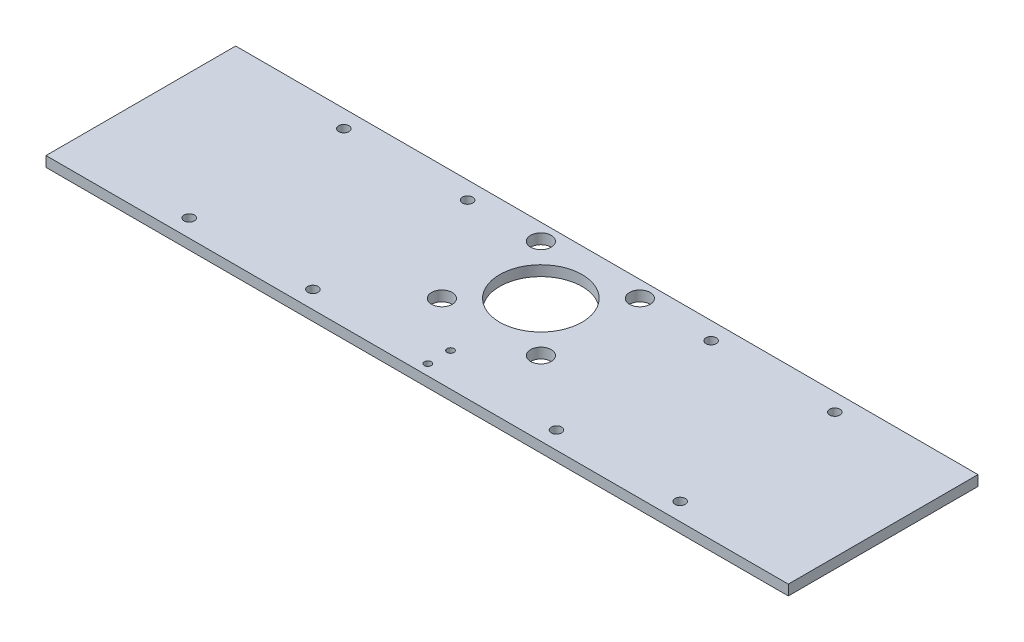
ISO-10303-21;
HEADER;
FILE_DESCRIPTION(('STEP AP214'),'2;1');
FILE_NAME('part.step','',(''),(''),'','','');
FILE_SCHEMA(('AUTOMOTIVE_DESIGN { 1 0 10303 214 1 1 1 1 }'));
ENDSEC;
DATA;
#1=APPLICATION_CONTEXT('core data for automotive mechanical design processes');
#2=APPLICATION_PROTOCOL_DEFINITION('international standard','automotive_design',2000,#1);
#3=PRODUCT_CONTEXT('',#1,'mechanical');
#4=PRODUCT('Part','Part','',(#3));
#5=PRODUCT_RELATED_PRODUCT_CATEGORY('part','',(#4));
#6=PRODUCT_DEFINITION_FORMATION('','',#4);
#7=PRODUCT_DEFINITION_CONTEXT('part definition',#1,'design');
#8=PRODUCT_DEFINITION('design','',#6,#7);
#9=PRODUCT_DEFINITION_SHAPE('','',#8);
#10=(LENGTH_UNIT() NAMED_UNIT(*) SI_UNIT(.MILLI.,.METRE.));
#11=(NAMED_UNIT(*) PLANE_ANGLE_UNIT() SI_UNIT($,.RADIAN.));
#12=(NAMED_UNIT(*) SI_UNIT($,.STERADIAN.) SOLID_ANGLE_UNIT());
#13=UNCERTAINTY_MEASURE_WITH_UNIT(LENGTH_MEASURE(1.E-05),#10,'distance_accuracy_value','');
#14=(GEOMETRIC_REPRESENTATION_CONTEXT(3) GLOBAL_UNCERTAINTY_ASSIGNED_CONTEXT((#13)) GLOBAL_UNIT_ASSIGNED_CONTEXT((#10,
#11,#12)) REPRESENTATION_CONTEXT('',''));
#15=CARTESIAN_POINT('',(0.,0.,0.));
#16=DIRECTION('',(0.,0.,1.));
#17=DIRECTION('',(1.,0.,0.));
#18=AXIS2_PLACEMENT_3D('',#15,#16,#17);
#19=CARTESIAN_POINT('',(-228.6,3.175,-40.64));
#20=DIRECTION('',(1.,0.,0.));
#21=DIRECTION('',(0.,0.,-1.));
#22=AXIS2_PLACEMENT_3D('',#19,#20,#21);
#23=PLANE('',#22);
#24=DIRECTION('',(0.,0.,1.));
#25=VECTOR('',#24,1.);
#26=CARTESIAN_POINT('',(-228.6,-3.175,-40.64));
#27=LINE('',#26,#25);
#28=CARTESIAN_POINT('',(-228.6,-3.175,-40.64));
#29=VERTEX_POINT('',#28);
#30=CARTESIAN_POINT('',(-228.6,-3.175,76.2));
#31=VERTEX_POINT('',#30);
#32=EDGE_CURVE('E98',#29,#31,#27,.T.);
#33=ORIENTED_EDGE('',*,*,#32,.T.);
#34=DIRECTION('',(0.,-1.,0.));
#35=VECTOR('',#34,1.);
#36=CARTESIAN_POINT('',(-228.6,3.175,76.2));
#37=LINE('',#36,#35);
#38=CARTESIAN_POINT('',(-228.6,3.175,76.2));
#39=VERTEX_POINT('',#38);
#40=EDGE_CURVE('E11',#39,#31,#37,.T.);
#41=ORIENTED_EDGE('',*,*,#40,.F.);
#42=DIRECTION('',(0.,0.,1.));
#43=VECTOR('',#42,1.);
#44=CARTESIAN_POINT('',(-228.6,3.175,-40.64));
#45=LINE('',#44,#43);
#46=CARTESIAN_POINT('',(-228.6,3.175,-40.64));
#47=VERTEX_POINT('',#46);
#48=EDGE_CURVE('E86',#47,#39,#45,.T.);
#49=ORIENTED_EDGE('',*,*,#48,.F.);
#50=DIRECTION('',(0.,-1.,0.));
#51=VECTOR('',#50,1.);
#52=CARTESIAN_POINT('',(-228.6,3.175,-40.64));
#53=LINE('',#52,#51);
#54=EDGE_CURVE('E94',#47,#29,#53,.T.);
#55=ORIENTED_EDGE('',*,*,#54,.T.);
#56=EDGE_LOOP('',(#33,#41,#49,#55));
#57=FACE_BOUND('',#56,.T.);
#58=ADVANCED_FACE('F35',(#57),#23,.F.);
#59=CARTESIAN_POINT('',(-228.6,3.175,76.2));
#60=DIRECTION('',(0.,0.,-1.));
#61=DIRECTION('',(-1.,0.,0.));
#62=AXIS2_PLACEMENT_3D('',#59,#60,#61);
#63=PLANE('',#62);
#64=DIRECTION('',(1.,0.,0.));
#65=VECTOR('',#64,1.);
#66=CARTESIAN_POINT('',(-228.6,-3.175,76.2));
#67=LINE('',#66,#65);
#68=CARTESIAN_POINT('',(228.6,-3.175,76.2));
#69=VERTEX_POINT('',#68);
#70=EDGE_CURVE('E90',#31,#69,#67,.T.);
#71=ORIENTED_EDGE('',*,*,#70,.T.);
#72=DIRECTION('',(0.,-1.,0.));
#73=VECTOR('',#72,1.);
#74=CARTESIAN_POINT('',(228.6,3.175,76.2));
#75=LINE('',#74,#73);
#76=CARTESIAN_POINT('',(228.6,3.175,76.2));
#77=VERTEX_POINT('',#76);
#78=EDGE_CURVE('E43',#77,#69,#75,.T.);
#79=ORIENTED_EDGE('',*,*,#78,.F.);
#80=DIRECTION('',(1.,0.,0.));
#81=VECTOR('',#80,1.);
#82=CARTESIAN_POINT('',(-228.6,3.175,76.2));
#83=LINE('',#82,#81);
#84=EDGE_CURVE('E81',#39,#77,#83,.T.);
#85=ORIENTED_EDGE('',*,*,#84,.F.);
#86=ORIENTED_EDGE('',*,*,#40,.T.);
#87=EDGE_LOOP('',(#71,#79,#85,#86));
#88=FACE_BOUND('',#87,.T.);
#89=ADVANCED_FACE('F89',(#88),#63,.F.);
#90=CARTESIAN_POINT('',(228.6,3.175,-40.64));
#91=DIRECTION('',(-1.,0.,0.));
#92=DIRECTION('',(0.,0.,1.));
#93=AXIS2_PLACEMENT_3D('',#90,#91,#92);
#94=PLANE('',#93);
#95=DIRECTION('',(0.,0.,-1.));
#96=VECTOR('',#95,1.);
#97=CARTESIAN_POINT('',(228.6,-3.175,-40.64));
#98=LINE('',#97,#96);
#99=CARTESIAN_POINT('',(228.6,-3.175,-40.64));
#100=VERTEX_POINT('',#99);
#101=EDGE_CURVE('E68',#69,#100,#98,.T.);
#102=ORIENTED_EDGE('',*,*,#101,.T.);
#103=DIRECTION('',(0.,-1.,0.));
#104=VECTOR('',#103,1.);
#105=CARTESIAN_POINT('',(228.6,3.175,-40.64));
#106=LINE('',#105,#104);
#107=CARTESIAN_POINT('',(228.6,3.175,-40.64));
#108=VERTEX_POINT('',#107);
#109=EDGE_CURVE('E91',#108,#100,#106,.T.);
#110=ORIENTED_EDGE('',*,*,#109,.F.);
#111=DIRECTION('',(0.,0.,-1.));
#112=VECTOR('',#111,1.);
#113=CARTESIAN_POINT('',(228.6,3.175,-40.64));
#114=LINE('',#113,#112);
#115=EDGE_CURVE('E84',#77,#108,#114,.T.);
#116=ORIENTED_EDGE('',*,*,#115,.F.);
#117=ORIENTED_EDGE('',*,*,#78,.T.);
#118=EDGE_LOOP('',(#102,#110,#116,#117));
#119=FACE_BOUND('',#118,.T.);
#120=ADVANCED_FACE('F92',(#119),#94,.F.);
#121=CARTESIAN_POINT('',(-228.6,3.175,-40.64));
#122=DIRECTION('',(0.,0.,1.));
#123=DIRECTION('',(1.,0.,0.));
#124=AXIS2_PLACEMENT_3D('',#121,#122,#123);
#125=PLANE('',#124);
#126=DIRECTION('',(-1.,0.,0.));
#127=VECTOR('',#126,1.);
#128=CARTESIAN_POINT('',(-228.6,-3.175,-40.64));
#129=LINE('',#128,#127);
#130=EDGE_CURVE('E74',#100,#29,#129,.T.);
#131=ORIENTED_EDGE('',*,*,#130,.T.);
#132=ORIENTED_EDGE('',*,*,#54,.F.);
#133=DIRECTION('',(-1.,0.,0.));
#134=VECTOR('',#133,1.);
#135=CARTESIAN_POINT('',(-228.6,3.175,-40.64));
#136=LINE('',#135,#134);
#137=EDGE_CURVE('E51',#108,#47,#136,.T.);
#138=ORIENTED_EDGE('',*,*,#137,.F.);
#139=ORIENTED_EDGE('',*,*,#109,.T.);
#140=EDGE_LOOP('',(#131,#132,#138,#139));
#141=FACE_BOUND('',#140,.T.);
#142=ADVANCED_FACE('F106',(#141),#125,.F.);
#143=CARTESIAN_POINT('',(0.,3.175,0.));
#144=DIRECTION('',(0.,1.,0.));
#145=DIRECTION('',(0.,0.,1.));
#146=AXIS2_PLACEMENT_3D('',#143,#144,#145);
#147=PLANE('',#146);
#148=CARTESIAN_POINT('',(151.2,3.175,65.405));
#149=DIRECTION('',(0.,1.,0.));
#150=DIRECTION('',(0.,0.,1.));
#151=AXIS2_PLACEMENT_3D('',#148,#149,#150);
#152=CIRCLE('',#151,3.175);
#153=CARTESIAN_POINT('',(151.2,3.175,68.58));
#154=VERTEX_POINT('',#153);
#155=EDGE_CURVE('E198',#154,#154,#152,.T.);
#156=ORIENTED_EDGE('',*,*,#155,.F.);
#157=EDGE_LOOP('',(#156));
#158=FACE_BOUND('',#157,.T.);
#159=CARTESIAN_POINT('',(151.2,3.175,-29.845));
#160=DIRECTION('',(0.,1.,0.));
#161=DIRECTION('',(0.,0.,1.));
#162=AXIS2_PLACEMENT_3D('',#159,#160,#161);
#163=CIRCLE('',#162,3.175);
#164=CARTESIAN_POINT('',(151.2,3.175,-26.67));
#165=VERTEX_POINT('',#164);
#166=EDGE_CURVE('E192',#165,#165,#163,.T.);
#167=ORIENTED_EDGE('',*,*,#166,.F.);
#168=EDGE_LOOP('',(#167));
#169=FACE_BOUND('',#168,.T.);
#170=CARTESIAN_POINT('',(-151.2,3.175,65.4050000000001));
#171=DIRECTION('',(0.,1.,0.));
#172=DIRECTION('',(0.,0.,1.));
#173=AXIS2_PLACEMENT_3D('',#170,#171,#172);
#174=CIRCLE('',#173,3.175);
#175=CARTESIAN_POINT('',(-151.2,3.175,68.5800000000001));
#176=VERTEX_POINT('',#175);
#177=EDGE_CURVE('E186',#176,#176,#174,.T.);
#178=ORIENTED_EDGE('',*,*,#177,.F.);
#179=EDGE_LOOP('',(#178));
#180=FACE_BOUND('',#179,.T.);
#181=CARTESIAN_POINT('',(-151.2,3.175,-29.845));
#182=DIRECTION('',(0.,1.,0.));
#183=DIRECTION('',(0.,0.,1.));
#184=AXIS2_PLACEMENT_3D('',#181,#182,#183);
#185=CIRCLE('',#184,3.175);
#186=CARTESIAN_POINT('',(-151.2,3.175,-26.67));
#187=VERTEX_POINT('',#186);
#188=EDGE_CURVE('E180',#187,#187,#185,.T.);
#189=ORIENTED_EDGE('',*,*,#188,.F.);
#190=EDGE_LOOP('',(#189));
#191=FACE_BOUND('',#190,.T.);
#192=CARTESIAN_POINT('',(75.,3.175,65.405));
#193=DIRECTION('',(0.,1.,0.));
#194=DIRECTION('',(0.,0.,1.));
#195=AXIS2_PLACEMENT_3D('',#192,#193,#194);
#196=CIRCLE('',#195,3.175);
#197=CARTESIAN_POINT('',(75.,3.175,68.58));
#198=VERTEX_POINT('',#197);
#199=EDGE_CURVE('E174',#198,#198,#196,.T.);
#200=ORIENTED_EDGE('',*,*,#199,.F.);
#201=EDGE_LOOP('',(#200));
#202=FACE_BOUND('',#201,.T.);
#203=CARTESIAN_POINT('',(-75.,3.175,-29.845));
#204=DIRECTION('',(0.,1.,0.));
#205=DIRECTION('',(0.,0.,1.));
#206=AXIS2_PLACEMENT_3D('',#203,#204,#205);
#207=CIRCLE('',#206,3.175);
#208=CARTESIAN_POINT('',(-75.,3.175,-26.67));
#209=VERTEX_POINT('',#208);
#210=EDGE_CURVE('E168',#209,#209,#207,.T.);
#211=ORIENTED_EDGE('',*,*,#210,.F.);
#212=EDGE_LOOP('',(#211));
#213=FACE_BOUND('',#212,.T.);
#214=CARTESIAN_POINT('',(-75.,3.175,65.405));
#215=DIRECTION('',(0.,1.,0.));
#216=DIRECTION('',(0.,0.,1.));
#217=AXIS2_PLACEMENT_3D('',#214,#215,#216);
#218=CIRCLE('',#217,3.175);
#219=CARTESIAN_POINT('',(-75.,3.175,68.58));
#220=VERTEX_POINT('',#219);
#221=EDGE_CURVE('E162',#220,#220,#218,.T.);
#222=ORIENTED_EDGE('',*,*,#221,.F.);
#223=EDGE_LOOP('',(#222));
#224=FACE_BOUND('',#223,.T.);
#225=CARTESIAN_POINT('',(75.,3.175,-29.845));
#226=DIRECTION('',(0.,1.,0.));
#227=DIRECTION('',(0.,0.,1.));
#228=AXIS2_PLACEMENT_3D('',#225,#226,#227);
#229=CIRCLE('',#228,3.175);
#230=CARTESIAN_POINT('',(75.,3.175,-26.67));
#231=VERTEX_POINT('',#230);
#232=EDGE_CURVE('E156',#231,#231,#229,.T.);
#233=ORIENTED_EDGE('',*,*,#232,.F.);
#234=EDGE_LOOP('',(#233));
#235=FACE_BOUND('',#234,.T.);
#236=CARTESIAN_POINT('',(0.,3.175,55.63));
#237=DIRECTION('',(0.,1.,0.));
#238=DIRECTION('',(0.,0.,1.));
#239=AXIS2_PLACEMENT_3D('',#236,#237,#238);
#240=CIRCLE('',#239,2.1082);
#241=CARTESIAN_POINT('',(0.,3.175,57.7382));
#242=VERTEX_POINT('',#241);
#243=EDGE_CURVE('E150',#242,#242,#240,.T.);
#244=ORIENTED_EDGE('',*,*,#243,.F.);
#245=EDGE_LOOP('',(#244));
#246=FACE_BOUND('',#245,.T.);
#247=CARTESIAN_POINT('',(0.,3.175,69.63));
#248=DIRECTION('',(0.,1.,0.));
#249=DIRECTION('',(0.,0.,1.));
#250=AXIS2_PLACEMENT_3D('',#247,#248,#249);
#251=CIRCLE('',#250,2.1082);
#252=CARTESIAN_POINT('',(0.,3.175,71.7382));
#253=VERTEX_POINT('',#252);
#254=EDGE_CURVE('E144',#253,#253,#251,.T.);
#255=ORIENTED_EDGE('',*,*,#254,.F.);
#256=EDGE_LOOP('',(#255));
#257=FACE_BOUND('',#256,.T.);
#258=CARTESIAN_POINT('',(30.48,3.175,30.48));
#259=DIRECTION('',(0.,1.,0.));
#260=DIRECTION('',(0.,0.,1.));
#261=AXIS2_PLACEMENT_3D('',#258,#259,#260);
#262=CIRCLE('',#261,6.35);
#263=CARTESIAN_POINT('',(30.48,3.175,36.83));
#264=VERTEX_POINT('',#263);
#265=EDGE_CURVE('E138',#264,#264,#262,.T.);
#266=ORIENTED_EDGE('',*,*,#265,.F.);
#267=EDGE_LOOP('',(#266));
#268=FACE_BOUND('',#267,.T.);
#269=CARTESIAN_POINT('',(-30.48,3.175,-30.48));
#270=DIRECTION('',(0.,1.,0.));
#271=DIRECTION('',(0.,0.,1.));
#272=AXIS2_PLACEMENT_3D('',#269,#270,#271);
#273=CIRCLE('',#272,6.35);
#274=CARTESIAN_POINT('',(-30.48,3.175,-24.13));
#275=VERTEX_POINT('',#274);
#276=EDGE_CURVE('E132',#275,#275,#273,.T.);
#277=ORIENTED_EDGE('',*,*,#276,.F.);
#278=EDGE_LOOP('',(#277));
#279=FACE_BOUND('',#278,.T.);
#280=CARTESIAN_POINT('',(-30.48,3.175,30.48));
#281=DIRECTION('',(0.,1.,0.));
#282=DIRECTION('',(0.,0.,1.));
#283=AXIS2_PLACEMENT_3D('',#280,#281,#282);
#284=CIRCLE('',#283,6.35);
#285=CARTESIAN_POINT('',(-30.48,3.175,36.83));
#286=VERTEX_POINT('',#285);
#287=EDGE_CURVE('E126',#286,#286,#284,.T.);
#288=ORIENTED_EDGE('',*,*,#287,.F.);
#289=EDGE_LOOP('',(#288));
#290=FACE_BOUND('',#289,.T.);
#291=CARTESIAN_POINT('',(30.48,3.175,-30.48));
#292=DIRECTION('',(0.,1.,0.));
#293=DIRECTION('',(0.,0.,1.));
#294=AXIS2_PLACEMENT_3D('',#291,#292,#293);
#295=CIRCLE('',#294,6.35);
#296=CARTESIAN_POINT('',(30.48,3.175,-24.13));
#297=VERTEX_POINT('',#296);
#298=EDGE_CURVE('E120',#297,#297,#295,.T.);
#299=ORIENTED_EDGE('',*,*,#298,.F.);
#300=EDGE_LOOP('',(#299));
#301=FACE_BOUND('',#300,.T.);
#302=CARTESIAN_POINT('',(0.,3.175,0.));
#303=DIRECTION('',(0.,1.,0.));
#304=DIRECTION('',(0.,0.,1.));
#305=AXIS2_PLACEMENT_3D('',#302,#303,#304);
#306=CIRCLE('',#305,25.4);
#307=CARTESIAN_POINT('',(0.,3.175,25.4));
#308=VERTEX_POINT('',#307);
#309=EDGE_CURVE('E114',#308,#308,#306,.T.);
#310=ORIENTED_EDGE('',*,*,#309,.F.);
#311=EDGE_LOOP('',(#310));
#312=FACE_BOUND('',#311,.T.);
#313=ORIENTED_EDGE('',*,*,#48,.T.);
#314=ORIENTED_EDGE('',*,*,#84,.T.);
#315=ORIENTED_EDGE('',*,*,#115,.T.);
#316=ORIENTED_EDGE('',*,*,#137,.T.);
#317=EDGE_LOOP('',(#313,#314,#315,#316));
#318=FACE_BOUND('',#317,.T.);
#319=ADVANCED_FACE('F82',(#158,#169,#180,#191,#202,#213,#224,#235,#246,#257,#268,#279,#290,#301,
#312,#318),#147,.T.);
#320=CARTESIAN_POINT('',(0.,-3.175,0.));
#321=DIRECTION('',(0.,1.,0.));
#322=DIRECTION('',(0.,0.,1.));
#323=AXIS2_PLACEMENT_3D('',#320,#321,#322);
#324=PLANE('',#323);
#325=CARTESIAN_POINT('',(151.2,-3.175,65.405));
#326=DIRECTION('',(0.,1.,0.));
#327=DIRECTION('',(0.,0.,1.));
#328=AXIS2_PLACEMENT_3D('',#325,#326,#327);
#329=CIRCLE('',#328,3.175);
#330=CARTESIAN_POINT('',(151.2,-3.175,68.58));
#331=VERTEX_POINT('',#330);
#332=EDGE_CURVE('E195',#331,#331,#329,.F.);
#333=ORIENTED_EDGE('',*,*,#332,.F.);
#334=EDGE_LOOP('',(#333));
#335=FACE_BOUND('',#334,.T.);
#336=CARTESIAN_POINT('',(151.2,-3.175,-29.845));
#337=DIRECTION('',(0.,1.,0.));
#338=DIRECTION('',(0.,0.,1.));
#339=AXIS2_PLACEMENT_3D('',#336,#337,#338);
#340=CIRCLE('',#339,3.175);
#341=CARTESIAN_POINT('',(151.2,-3.175,-26.67));
#342=VERTEX_POINT('',#341);
#343=EDGE_CURVE('E189',#342,#342,#340,.F.);
#344=ORIENTED_EDGE('',*,*,#343,.F.);
#345=EDGE_LOOP('',(#344));
#346=FACE_BOUND('',#345,.T.);
#347=CARTESIAN_POINT('',(-151.2,-3.175,65.4050000000001));
#348=DIRECTION('',(0.,1.,0.));
#349=DIRECTION('',(0.,0.,1.));
#350=AXIS2_PLACEMENT_3D('',#347,#348,#349);
#351=CIRCLE('',#350,3.175);
#352=CARTESIAN_POINT('',(-151.2,-3.175,68.5800000000001));
#353=VERTEX_POINT('',#352);
#354=EDGE_CURVE('E183',#353,#353,#351,.F.);
#355=ORIENTED_EDGE('',*,*,#354,.F.);
#356=EDGE_LOOP('',(#355));
#357=FACE_BOUND('',#356,.T.);
#358=CARTESIAN_POINT('',(-151.2,-3.175,-29.845));
#359=DIRECTION('',(0.,1.,0.));
#360=DIRECTION('',(0.,0.,1.));
#361=AXIS2_PLACEMENT_3D('',#358,#359,#360);
#362=CIRCLE('',#361,3.175);
#363=CARTESIAN_POINT('',(-151.2,-3.175,-26.67));
#364=VERTEX_POINT('',#363);
#365=EDGE_CURVE('E177',#364,#364,#362,.F.);
#366=ORIENTED_EDGE('',*,*,#365,.F.);
#367=EDGE_LOOP('',(#366));
#368=FACE_BOUND('',#367,.T.);
#369=CARTESIAN_POINT('',(75.,-3.175,65.405));
#370=DIRECTION('',(0.,1.,0.));
#371=DIRECTION('',(0.,0.,1.));
#372=AXIS2_PLACEMENT_3D('',#369,#370,#371);
#373=CIRCLE('',#372,3.175);
#374=CARTESIAN_POINT('',(75.,-3.175,68.58));
#375=VERTEX_POINT('',#374);
#376=EDGE_CURVE('E171',#375,#375,#373,.T.);
#377=ORIENTED_EDGE('',*,*,#376,.T.);
#378=EDGE_LOOP('',(#377));
#379=FACE_BOUND('',#378,.T.);
#380=CARTESIAN_POINT('',(-75.,-3.175,-29.845));
#381=DIRECTION('',(0.,1.,0.));
#382=DIRECTION('',(0.,0.,1.));
#383=AXIS2_PLACEMENT_3D('',#380,#381,#382);
#384=CIRCLE('',#383,3.175);
#385=CARTESIAN_POINT('',(-75.,-3.175,-26.67));
#386=VERTEX_POINT('',#385);
#387=EDGE_CURVE('E165',#386,#386,#384,.T.);
#388=ORIENTED_EDGE('',*,*,#387,.T.);
#389=EDGE_LOOP('',(#388));
#390=FACE_BOUND('',#389,.T.);
#391=CARTESIAN_POINT('',(-75.,-3.175,65.405));
#392=DIRECTION('',(0.,1.,0.));
#393=DIRECTION('',(0.,0.,1.));
#394=AXIS2_PLACEMENT_3D('',#391,#392,#393);
#395=CIRCLE('',#394,3.175);
#396=CARTESIAN_POINT('',(-75.,-3.175,68.58));
#397=VERTEX_POINT('',#396);
#398=EDGE_CURVE('E159',#397,#397,#395,.T.);
#399=ORIENTED_EDGE('',*,*,#398,.T.);
#400=EDGE_LOOP('',(#399));
#401=FACE_BOUND('',#400,.T.);
#402=CARTESIAN_POINT('',(75.,-3.175,-29.845));
#403=DIRECTION('',(0.,1.,0.));
#404=DIRECTION('',(0.,0.,1.));
#405=AXIS2_PLACEMENT_3D('',#402,#403,#404);
#406=CIRCLE('',#405,3.175);
#407=CARTESIAN_POINT('',(75.,-3.175,-26.67));
#408=VERTEX_POINT('',#407);
#409=EDGE_CURVE('E153',#408,#408,#406,.T.);
#410=ORIENTED_EDGE('',*,*,#409,.T.);
#411=EDGE_LOOP('',(#410));
#412=FACE_BOUND('',#411,.T.);
#413=CARTESIAN_POINT('',(0.,-3.175,55.63));
#414=DIRECTION('',(0.,1.,0.));
#415=DIRECTION('',(0.,0.,1.));
#416=AXIS2_PLACEMENT_3D('',#413,#414,#415);
#417=CIRCLE('',#416,2.1082);
#418=CARTESIAN_POINT('',(0.,-3.175,57.7382));
#419=VERTEX_POINT('',#418);
#420=EDGE_CURVE('E147',#419,#419,#417,.T.);
#421=ORIENTED_EDGE('',*,*,#420,.T.);
#422=EDGE_LOOP('',(#421));
#423=FACE_BOUND('',#422,.T.);
#424=CARTESIAN_POINT('',(0.,-3.175,69.63));
#425=DIRECTION('',(0.,1.,0.));
#426=DIRECTION('',(0.,0.,1.));
#427=AXIS2_PLACEMENT_3D('',#424,#425,#426);
#428=CIRCLE('',#427,2.1082);
#429=CARTESIAN_POINT('',(0.,-3.175,71.7382));
#430=VERTEX_POINT('',#429);
#431=EDGE_CURVE('E141',#430,#430,#428,.T.);
#432=ORIENTED_EDGE('',*,*,#431,.T.);
#433=EDGE_LOOP('',(#432));
#434=FACE_BOUND('',#433,.T.);
#435=CARTESIAN_POINT('',(30.48,-3.175,30.48));
#436=DIRECTION('',(0.,1.,0.));
#437=DIRECTION('',(0.,0.,1.));
#438=AXIS2_PLACEMENT_3D('',#435,#436,#437);
#439=CIRCLE('',#438,6.35);
#440=CARTESIAN_POINT('',(30.48,-3.175,36.83));
#441=VERTEX_POINT('',#440);
#442=EDGE_CURVE('E135',#441,#441,#439,.T.);
#443=ORIENTED_EDGE('',*,*,#442,.T.);
#444=EDGE_LOOP('',(#443));
#445=FACE_BOUND('',#444,.T.);
#446=CARTESIAN_POINT('',(-30.48,-3.175,-30.48));
#447=DIRECTION('',(0.,1.,0.));
#448=DIRECTION('',(0.,0.,1.));
#449=AXIS2_PLACEMENT_3D('',#446,#447,#448);
#450=CIRCLE('',#449,6.35);
#451=CARTESIAN_POINT('',(-30.48,-3.175,-24.13));
#452=VERTEX_POINT('',#451);
#453=EDGE_CURVE('E129',#452,#452,#450,.T.);
#454=ORIENTED_EDGE('',*,*,#453,.T.);
#455=EDGE_LOOP('',(#454));
#456=FACE_BOUND('',#455,.T.);
#457=CARTESIAN_POINT('',(-30.48,-3.175,30.48));
#458=DIRECTION('',(0.,1.,0.));
#459=DIRECTION('',(0.,0.,1.));
#460=AXIS2_PLACEMENT_3D('',#457,#458,#459);
#461=CIRCLE('',#460,6.35);
#462=CARTESIAN_POINT('',(-30.48,-3.175,36.83));
#463=VERTEX_POINT('',#462);
#464=EDGE_CURVE('E123',#463,#463,#461,.T.);
#465=ORIENTED_EDGE('',*,*,#464,.T.);
#466=EDGE_LOOP('',(#465));
#467=FACE_BOUND('',#466,.T.);
#468=CARTESIAN_POINT('',(30.48,-3.175,-30.48));
#469=DIRECTION('',(0.,1.,0.));
#470=DIRECTION('',(0.,0.,1.));
#471=AXIS2_PLACEMENT_3D('',#468,#469,#470);
#472=CIRCLE('',#471,6.35);
#473=CARTESIAN_POINT('',(30.48,-3.175,-24.13));
#474=VERTEX_POINT('',#473);
#475=EDGE_CURVE('E117',#474,#474,#472,.T.);
#476=ORIENTED_EDGE('',*,*,#475,.T.);
#477=EDGE_LOOP('',(#476));
#478=FACE_BOUND('',#477,.T.);
#479=CARTESIAN_POINT('',(0.,-3.175,0.));
#480=DIRECTION('',(0.,1.,0.));
#481=DIRECTION('',(0.,0.,1.));
#482=AXIS2_PLACEMENT_3D('',#479,#480,#481);
#483=CIRCLE('',#482,25.4);
#484=CARTESIAN_POINT('',(0.,-3.175,25.4));
#485=VERTEX_POINT('',#484);
#486=EDGE_CURVE('E101',#485,#485,#483,.T.);
#487=ORIENTED_EDGE('',*,*,#486,.T.);
#488=EDGE_LOOP('',(#487));
#489=FACE_BOUND('',#488,.T.);
#490=ORIENTED_EDGE('',*,*,#32,.F.);
#491=ORIENTED_EDGE('',*,*,#130,.F.);
#492=ORIENTED_EDGE('',*,*,#101,.F.);
#493=ORIENTED_EDGE('',*,*,#70,.F.);
#494=EDGE_LOOP('',(#490,#491,#492,#493));
#495=FACE_BOUND('',#494,.T.);
#496=ADVANCED_FACE('F109',(#335,#346,#357,#368,#379,#390,#401,#412,#423,#434,#445,#456,#467,
#478,#489,#495),#324,.F.);
#497=CARTESIAN_POINT('',(0.,3.175,0.));
#498=DIRECTION('',(0.,1.,0.));
#499=DIRECTION('',(0.,0.,1.));
#500=AXIS2_PLACEMENT_3D('',#497,#498,#499);
#501=CYLINDRICAL_SURFACE('',#500,25.4);
#502=ORIENTED_EDGE('',*,*,#486,.F.);
#503=EDGE_LOOP('',(#502));
#504=FACE_BOUND('',#503,.T.);
#505=ORIENTED_EDGE('',*,*,#309,.T.);
#506=EDGE_LOOP('',(#505));
#507=FACE_BOUND('',#506,.T.);
#508=ADVANCED_FACE('F236',(#504,#507),#501,.F.);
#509=CARTESIAN_POINT('',(30.48,3.175,-30.48));
#510=DIRECTION('',(0.,1.,0.));
#511=DIRECTION('',(0.,0.,1.));
#512=AXIS2_PLACEMENT_3D('',#509,#510,#511);
#513=CYLINDRICAL_SURFACE('',#512,6.35);
#514=ORIENTED_EDGE('',*,*,#475,.F.);
#515=EDGE_LOOP('',(#514));
#516=FACE_BOUND('',#515,.T.);
#517=ORIENTED_EDGE('',*,*,#298,.T.);
#518=EDGE_LOOP('',(#517));
#519=FACE_BOUND('',#518,.T.);
#520=ADVANCED_FACE('F238',(#516,#519),#513,.F.);
#521=CARTESIAN_POINT('',(-30.48,3.175,30.48));
#522=DIRECTION('',(0.,1.,0.));
#523=DIRECTION('',(0.,0.,1.));
#524=AXIS2_PLACEMENT_3D('',#521,#522,#523);
#525=CYLINDRICAL_SURFACE('',#524,6.35);
#526=ORIENTED_EDGE('',*,*,#464,.F.);
#527=EDGE_LOOP('',(#526));
#528=FACE_BOUND('',#527,.T.);
#529=ORIENTED_EDGE('',*,*,#287,.T.);
#530=EDGE_LOOP('',(#529));
#531=FACE_BOUND('',#530,.T.);
#532=ADVANCED_FACE('F245',(#528,#531),#525,.F.);
#533=CARTESIAN_POINT('',(-30.48,3.175,-30.48));
#534=DIRECTION('',(0.,1.,0.));
#535=DIRECTION('',(0.,0.,1.));
#536=AXIS2_PLACEMENT_3D('',#533,#534,#535);
#537=CYLINDRICAL_SURFACE('',#536,6.35);
#538=ORIENTED_EDGE('',*,*,#453,.F.);
#539=EDGE_LOOP('',(#538));
#540=FACE_BOUND('',#539,.T.);
#541=ORIENTED_EDGE('',*,*,#276,.T.);
#542=EDGE_LOOP('',(#541));
#543=FACE_BOUND('',#542,.T.);
#544=ADVANCED_FACE('F348',(#540,#543),#537,.F.);
#545=CARTESIAN_POINT('',(30.48,3.175,30.48));
#546=DIRECTION('',(0.,1.,0.));
#547=DIRECTION('',(0.,0.,1.));
#548=AXIS2_PLACEMENT_3D('',#545,#546,#547);
#549=CYLINDRICAL_SURFACE('',#548,6.35);
#550=ORIENTED_EDGE('',*,*,#442,.F.);
#551=EDGE_LOOP('',(#550));
#552=FACE_BOUND('',#551,.T.);
#553=ORIENTED_EDGE('',*,*,#265,.T.);
#554=EDGE_LOOP('',(#553));
#555=FACE_BOUND('',#554,.T.);
#556=ADVANCED_FACE('F344',(#552,#555),#549,.F.);
#557=CARTESIAN_POINT('',(0.,3.175,69.63));
#558=DIRECTION('',(0.,1.,0.));
#559=DIRECTION('',(0.,0.,1.));
#560=AXIS2_PLACEMENT_3D('',#557,#558,#559);
#561=CYLINDRICAL_SURFACE('',#560,2.1082);
#562=ORIENTED_EDGE('',*,*,#431,.F.);
#563=EDGE_LOOP('',(#562));
#564=FACE_BOUND('',#563,.T.);
#565=ORIENTED_EDGE('',*,*,#254,.T.);
#566=EDGE_LOOP('',(#565));
#567=FACE_BOUND('',#566,.T.);
#568=ADVANCED_FACE('F340',(#564,#567),#561,.F.);
#569=CARTESIAN_POINT('',(0.,3.175,55.63));
#570=DIRECTION('',(0.,1.,0.));
#571=DIRECTION('',(0.,0.,1.));
#572=AXIS2_PLACEMENT_3D('',#569,#570,#571);
#573=CYLINDRICAL_SURFACE('',#572,2.1082);
#574=ORIENTED_EDGE('',*,*,#420,.F.);
#575=EDGE_LOOP('',(#574));
#576=FACE_BOUND('',#575,.T.);
#577=ORIENTED_EDGE('',*,*,#243,.T.);
#578=EDGE_LOOP('',(#577));
#579=FACE_BOUND('',#578,.T.);
#580=ADVANCED_FACE('F336',(#576,#579),#573,.F.);
#581=CARTESIAN_POINT('',(75.,3.175,-29.845));
#582=DIRECTION('',(0.,1.,0.));
#583=DIRECTION('',(0.,0.,1.));
#584=AXIS2_PLACEMENT_3D('',#581,#582,#583);
#585=CYLINDRICAL_SURFACE('',#584,3.175);
#586=ORIENTED_EDGE('',*,*,#409,.F.);
#587=EDGE_LOOP('',(#586));
#588=FACE_BOUND('',#587,.T.);
#589=ORIENTED_EDGE('',*,*,#232,.T.);
#590=EDGE_LOOP('',(#589));
#591=FACE_BOUND('',#590,.T.);
#592=ADVANCED_FACE('F332',(#588,#591),#585,.F.);
#593=CARTESIAN_POINT('',(-75.,3.175,65.405));
#594=DIRECTION('',(0.,1.,0.));
#595=DIRECTION('',(0.,0.,1.));
#596=AXIS2_PLACEMENT_3D('',#593,#594,#595);
#597=CYLINDRICAL_SURFACE('',#596,3.175);
#598=ORIENTED_EDGE('',*,*,#398,.F.);
#599=EDGE_LOOP('',(#598));
#600=FACE_BOUND('',#599,.T.);
#601=ORIENTED_EDGE('',*,*,#221,.T.);
#602=EDGE_LOOP('',(#601));
#603=FACE_BOUND('',#602,.T.);
#604=ADVANCED_FACE('F328',(#600,#603),#597,.F.);
#605=CARTESIAN_POINT('',(-75.,3.175,-29.845));
#606=DIRECTION('',(0.,1.,0.));
#607=DIRECTION('',(0.,0.,1.));
#608=AXIS2_PLACEMENT_3D('',#605,#606,#607);
#609=CYLINDRICAL_SURFACE('',#608,3.175);
#610=ORIENTED_EDGE('',*,*,#387,.F.);
#611=EDGE_LOOP('',(#610));
#612=FACE_BOUND('',#611,.T.);
#613=ORIENTED_EDGE('',*,*,#210,.T.);
#614=EDGE_LOOP('',(#613));
#615=FACE_BOUND('',#614,.T.);
#616=ADVANCED_FACE('F324',(#612,#615),#609,.F.);
#617=CARTESIAN_POINT('',(75.,3.175,65.405));
#618=DIRECTION('',(0.,1.,0.));
#619=DIRECTION('',(0.,0.,1.));
#620=AXIS2_PLACEMENT_3D('',#617,#618,#619);
#621=CYLINDRICAL_SURFACE('',#620,3.175);
#622=ORIENTED_EDGE('',*,*,#376,.F.);
#623=EDGE_LOOP('',(#622));
#624=FACE_BOUND('',#623,.T.);
#625=ORIENTED_EDGE('',*,*,#199,.T.);
#626=EDGE_LOOP('',(#625));
#627=FACE_BOUND('',#626,.T.);
#628=ADVANCED_FACE('F288',(#624,#627),#621,.F.);
#629=CARTESIAN_POINT('',(-151.2,-3.176,-29.845));
#630=DIRECTION('',(0.,1.,0.));
#631=DIRECTION('',(0.,0.,1.));
#632=AXIS2_PLACEMENT_3D('',#629,#630,#631);
#633=CYLINDRICAL_SURFACE('',#632,3.175);
#634=ORIENTED_EDGE('',*,*,#188,.T.);
#635=EDGE_LOOP('',(#634));
#636=FACE_BOUND('',#635,.T.);
#637=ORIENTED_EDGE('',*,*,#365,.T.);
#638=EDGE_LOOP('',(#637));
#639=FACE_BOUND('',#638,.T.);
#640=ADVANCED_FACE('F282',(#636,#639),#633,.F.);
#641=CARTESIAN_POINT('',(-151.2,-3.176,65.4050000000001));
#642=DIRECTION('',(0.,1.,0.));
#643=DIRECTION('',(0.,0.,1.));
#644=AXIS2_PLACEMENT_3D('',#641,#642,#643);
#645=CYLINDRICAL_SURFACE('',#644,3.175);
#646=ORIENTED_EDGE('',*,*,#177,.T.);
#647=EDGE_LOOP('',(#646));
#648=FACE_BOUND('',#647,.T.);
#649=ORIENTED_EDGE('',*,*,#354,.T.);
#650=EDGE_LOOP('',(#649));
#651=FACE_BOUND('',#650,.T.);
#652=ADVANCED_FACE('F287',(#648,#651),#645,.F.);
#653=CARTESIAN_POINT('',(151.2,-3.176,-29.845));
#654=DIRECTION('',(0.,1.,0.));
#655=DIRECTION('',(0.,0.,1.));
#656=AXIS2_PLACEMENT_3D('',#653,#654,#655);
#657=CYLINDRICAL_SURFACE('',#656,3.175);
#658=ORIENTED_EDGE('',*,*,#166,.T.);
#659=EDGE_LOOP('',(#658));
#660=FACE_BOUND('',#659,.T.);
#661=ORIENTED_EDGE('',*,*,#343,.T.);
#662=EDGE_LOOP('',(#661));
#663=FACE_BOUND('',#662,.T.);
#664=ADVANCED_FACE('F300',(#660,#663),#657,.F.);
#665=CARTESIAN_POINT('',(151.2,-3.176,65.405));
#666=DIRECTION('',(0.,1.,0.));
#667=DIRECTION('',(0.,0.,1.));
#668=AXIS2_PLACEMENT_3D('',#665,#666,#667);
#669=CYLINDRICAL_SURFACE('',#668,3.175);
#670=ORIENTED_EDGE('',*,*,#155,.T.);
#671=EDGE_LOOP('',(#670));
#672=FACE_BOUND('',#671,.T.);
#673=ORIENTED_EDGE('',*,*,#332,.T.);
#674=EDGE_LOOP('',(#673));
#675=FACE_BOUND('',#674,.T.);
#676=ADVANCED_FACE('F202',(#672,#675),#669,.F.);
#677=CLOSED_SHELL('',(#58,#89,#120,#142,#319,#496,#508,#520,#532,#544,#556,#568,#580,#592,#604,
#616,#628,#640,#652,#664,#676));
#678=MANIFOLD_SOLID_BREP('B2',#677);
#679=ADVANCED_BREP_SHAPE_REPRESENTATION('',(#18,#678),#14);
#680=SHAPE_DEFINITION_REPRESENTATION(#9,#679);
ENDSEC;
END-ISO-10303-21;
